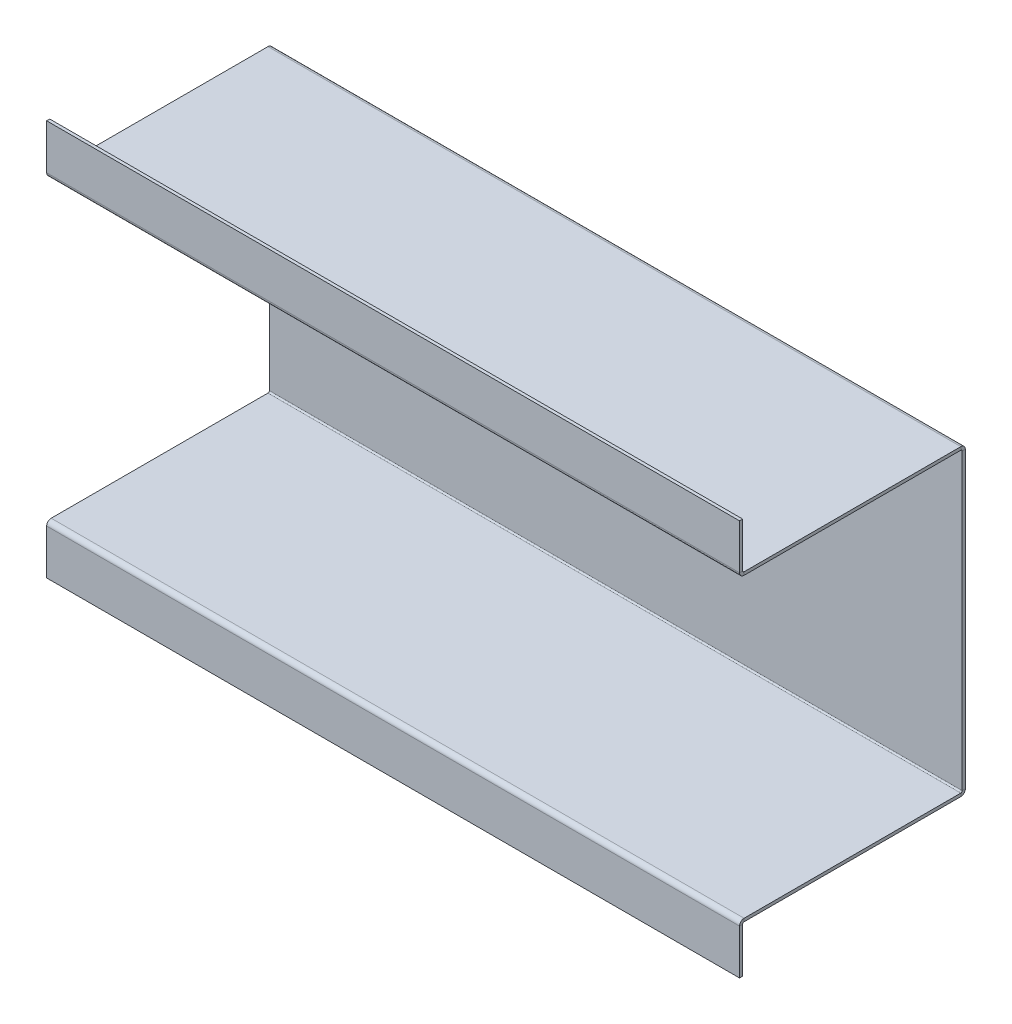
ISO-10303-21;
HEADER;
FILE_DESCRIPTION(('STEP AP214'),'2;1');
FILE_NAME('part.step','',(''),(''),'','','');
FILE_SCHEMA(('AUTOMOTIVE_DESIGN { 1 0 10303 214 1 1 1 1 }'));
ENDSEC;
DATA;
#1=APPLICATION_CONTEXT('core data for automotive mechanical design processes');
#2=APPLICATION_PROTOCOL_DEFINITION('international standard','automotive_design',2000,#1);
#3=PRODUCT_CONTEXT('',#1,'mechanical');
#4=PRODUCT('Part','Part','',(#3));
#5=PRODUCT_RELATED_PRODUCT_CATEGORY('part','',(#4));
#6=PRODUCT_DEFINITION_FORMATION('','',#4);
#7=PRODUCT_DEFINITION_CONTEXT('part definition',#1,'design');
#8=PRODUCT_DEFINITION('design','',#6,#7);
#9=PRODUCT_DEFINITION_SHAPE('','',#8);
#10=(LENGTH_UNIT() NAMED_UNIT(*) SI_UNIT(.MILLI.,.METRE.));
#11=(NAMED_UNIT(*) PLANE_ANGLE_UNIT() SI_UNIT($,.RADIAN.));
#12=(NAMED_UNIT(*) SI_UNIT($,.STERADIAN.) SOLID_ANGLE_UNIT());
#13=UNCERTAINTY_MEASURE_WITH_UNIT(LENGTH_MEASURE(1.E-05),#10,'distance_accuracy_value','');
#14=(GEOMETRIC_REPRESENTATION_CONTEXT(3) GLOBAL_UNCERTAINTY_ASSIGNED_CONTEXT((#13)) GLOBAL_UNIT_ASSIGNED_CONTEXT((#10,
#11,#12)) REPRESENTATION_CONTEXT('',''));
#15=CARTESIAN_POINT('',(0.,0.,0.));
#16=DIRECTION('',(0.,0.,1.));
#17=DIRECTION('',(1.,0.,0.));
#18=AXIS2_PLACEMENT_3D('',#15,#16,#17);
#19=CARTESIAN_POINT('',(355.6,-1.58750000000039,112.7125));
#20=DIRECTION('',(-1.,0.,0.));
#21=DIRECTION('',(0.,0.,1.));
#22=AXIS2_PLACEMENT_3D('',#19,#20,#21);
#23=PLANE('',#22);
#24=DIRECTION('',(0.,1.,0.));
#25=VECTOR('',#24,1.);
#26=CARTESIAN_POINT('',(355.6,-1.58750000000039,111.9759));
#27=LINE('',#26,#25);
#28=CARTESIAN_POINT('',(355.6,-1.58750000000039,111.9759));
#29=VERTEX_POINT('',#28);
#30=CARTESIAN_POINT('',(355.6,-3.90961765250165E-13,111.9759));
#31=VERTEX_POINT('',#30);
#32=EDGE_CURVE('E233',#29,#31,#27,.T.);
#33=ORIENTED_EDGE('',*,*,#32,.F.);
#34=DIRECTION('',(0.,0.,1.));
#35=VECTOR('',#34,1.);
#36=CARTESIAN_POINT('',(355.6,-1.58750000000039,112.7125));
#37=LINE('',#36,#35);
#38=CARTESIAN_POINT('',(355.6,-1.5875,0.736599999999992));
#39=VERTEX_POINT('',#38);
#40=EDGE_CURVE('E298',#39,#29,#37,.T.);
#41=ORIENTED_EDGE('',*,*,#40,.F.);
#42=DIRECTION('',(0.,-1.,0.));
#43=VECTOR('',#42,1.);
#44=CARTESIAN_POINT('',(355.6,0.,0.736599999999997));
#45=LINE('',#44,#43);
#46=CARTESIAN_POINT('',(355.6,0.,0.736599999999997));
#47=VERTEX_POINT('',#46);
#48=EDGE_CURVE('E289',#47,#39,#45,.T.);
#49=ORIENTED_EDGE('',*,*,#48,.F.);
#50=DIRECTION('',(0.,0.,1.));
#51=VECTOR('',#50,1.);
#52=CARTESIAN_POINT('',(355.6,-3.93533590404357E-13,112.7125));
#53=LINE('',#52,#51);
#54=EDGE_CURVE('E297',#47,#31,#53,.T.);
#55=ORIENTED_EDGE('',*,*,#54,.T.);
#56=EDGE_LOOP('',(#33,#41,#49,#55));
#57=FACE_BOUND('',#56,.T.);
#58=ADVANCED_FACE('F39',(#57),#23,.F.);
#59=CARTESIAN_POINT('',(0.,-1.5875,0.));
#60=DIRECTION('',(1.,0.,0.));
#61=DIRECTION('',(0.,0.,-1.));
#62=AXIS2_PLACEMENT_3D('',#59,#60,#61);
#63=PLANE('',#62);
#64=DIRECTION('',(0.,1.,0.));
#65=VECTOR('',#64,1.);
#66=CARTESIAN_POINT('',(0.,-1.58750000000039,111.9759));
#67=LINE('',#66,#65);
#68=CARTESIAN_POINT('',(0.,-1.58750000000039,111.9759));
#69=VERTEX_POINT('',#68);
#70=CARTESIAN_POINT('',(0.,-3.94215909915729E-13,111.9759));
#71=VERTEX_POINT('',#70);
#72=EDGE_CURVE('E226',#69,#71,#67,.T.);
#73=ORIENTED_EDGE('',*,*,#72,.T.);
#74=DIRECTION('',(0.,0.,-1.));
#75=VECTOR('',#74,1.);
#76=CARTESIAN_POINT('',(0.,0.,0.));
#77=LINE('',#76,#75);
#78=CARTESIAN_POINT('',(0.,0.,0.736599999999997));
#79=VERTEX_POINT('',#78);
#80=EDGE_CURVE('E302',#71,#79,#77,.T.);
#81=ORIENTED_EDGE('',*,*,#80,.T.);
#82=DIRECTION('',(0.,-1.,0.));
#83=VECTOR('',#82,1.);
#84=CARTESIAN_POINT('',(0.,0.,0.736599999999997));
#85=LINE('',#84,#83);
#86=CARTESIAN_POINT('',(0.,-1.5875,0.736599999999992));
#87=VERTEX_POINT('',#86);
#88=EDGE_CURVE('E284',#79,#87,#85,.T.);
#89=ORIENTED_EDGE('',*,*,#88,.T.);
#90=DIRECTION('',(0.,0.,-1.));
#91=VECTOR('',#90,1.);
#92=CARTESIAN_POINT('',(0.,-1.5875,0.));
#93=LINE('',#92,#91);
#94=EDGE_CURVE('E301',#69,#87,#93,.T.);
#95=ORIENTED_EDGE('',*,*,#94,.F.);
#96=EDGE_LOOP('',(#73,#81,#89,#95));
#97=FACE_BOUND('',#96,.T.);
#98=ADVANCED_FACE('F460',(#97),#63,.F.);
#99=CARTESIAN_POINT('',(0.,-1.5875,0.));
#100=DIRECTION('',(0.,1.,0.));
#101=DIRECTION('',(0.,0.,1.));
#102=AXIS2_PLACEMENT_3D('',#99,#100,#101);
#103=PLANE('',#102);
#104=DIRECTION('',(-1.,0.,0.));
#105=VECTOR('',#104,1.);
#106=CARTESIAN_POINT('',(0.,-1.58750000000039,111.9759));
#107=LINE('',#106,#105);
#108=EDGE_CURVE('E230',#69,#29,#107,.F.);
#109=ORIENTED_EDGE('',*,*,#108,.F.);
#110=ORIENTED_EDGE('',*,*,#94,.T.);
#111=DIRECTION('',(-1.,0.,0.));
#112=VECTOR('',#111,1.);
#113=CARTESIAN_POINT('',(0.,-1.5875,0.736599999999992));
#114=LINE('',#113,#112);
#115=EDGE_CURVE('E292',#39,#87,#114,.T.);
#116=ORIENTED_EDGE('',*,*,#115,.F.);
#117=ORIENTED_EDGE('',*,*,#40,.T.);
#118=EDGE_LOOP('',(#109,#110,#116,#117));
#119=FACE_BOUND('',#118,.T.);
#120=ADVANCED_FACE('F466',(#119),#103,.F.);
#121=CARTESIAN_POINT('',(0.,0.,0.));
#122=DIRECTION('',(0.,1.,0.));
#123=DIRECTION('',(0.,0.,1.));
#124=AXIS2_PLACEMENT_3D('',#121,#122,#123);
#125=PLANE('',#124);
#126=ORIENTED_EDGE('',*,*,#80,.F.);
#127=DIRECTION('',(-1.,0.,0.));
#128=VECTOR('',#127,1.);
#129=CARTESIAN_POINT('',(0.,-3.94215909915729E-13,111.9759));
#130=LINE('',#129,#128);
#131=EDGE_CURVE('E181',#71,#31,#130,.F.);
#132=ORIENTED_EDGE('',*,*,#131,.T.);
#133=ORIENTED_EDGE('',*,*,#54,.F.);
#134=DIRECTION('',(1.,0.,0.));
#135=VECTOR('',#134,1.);
#136=CARTESIAN_POINT('',(0.,0.,0.736599999999997));
#137=LINE('',#136,#135);
#138=EDGE_CURVE('E287',#79,#47,#137,.T.);
#139=ORIENTED_EDGE('',*,*,#138,.F.);
#140=EDGE_LOOP('',(#126,#132,#133,#139));
#141=FACE_BOUND('',#140,.T.);
#142=ADVANCED_FACE('F491',(#141),#125,.T.);
#143=CARTESIAN_POINT('',(0.,153.9875,112.7125));
#144=DIRECTION('',(1.,0.,0.));
#145=DIRECTION('',(0.,0.,-1.));
#146=AXIS2_PLACEMENT_3D('',#143,#144,#145);
#147=PLANE('',#146);
#148=DIRECTION('',(0.,-1.,0.));
#149=VECTOR('',#148,1.);
#150=CARTESIAN_POINT('',(0.,153.9875,111.9759));
#151=LINE('',#150,#149);
#152=CARTESIAN_POINT('',(0.,153.9875,111.9759));
#153=VERTEX_POINT('',#152);
#154=CARTESIAN_POINT('',(0.,152.4,111.9759));
#155=VERTEX_POINT('',#154);
#156=EDGE_CURVE('E282',#153,#155,#151,.T.);
#157=ORIENTED_EDGE('',*,*,#156,.F.);
#158=DIRECTION('',(0.,0.,1.));
#159=VECTOR('',#158,1.);
#160=CARTESIAN_POINT('',(0.,153.9875,112.7125));
#161=LINE('',#160,#159);
#162=CARTESIAN_POINT('',(0.,153.9875,0.736599999999998));
#163=VERTEX_POINT('',#162);
#164=EDGE_CURVE('E343',#163,#153,#161,.T.);
#165=ORIENTED_EDGE('',*,*,#164,.F.);
#166=DIRECTION('',(0.,1.,0.));
#167=VECTOR('',#166,1.);
#168=CARTESIAN_POINT('',(0.,152.4,0.736600000000004));
#169=LINE('',#168,#167);
#170=CARTESIAN_POINT('',(0.,152.4,0.736600000000004));
#171=VERTEX_POINT('',#170);
#172=EDGE_CURVE('E334',#171,#163,#169,.T.);
#173=ORIENTED_EDGE('',*,*,#172,.F.);
#174=DIRECTION('',(0.,0.,1.));
#175=VECTOR('',#174,1.);
#176=CARTESIAN_POINT('',(0.,152.4,112.7125));
#177=LINE('',#176,#175);
#178=EDGE_CURVE('E342',#171,#155,#177,.T.);
#179=ORIENTED_EDGE('',*,*,#178,.T.);
#180=EDGE_LOOP('',(#157,#165,#173,#179));
#181=FACE_BOUND('',#180,.T.);
#182=ADVANCED_FACE('F402',(#181),#147,.F.);
#183=CARTESIAN_POINT('',(355.6,153.9875,0.));
#184=DIRECTION('',(-1.,0.,0.));
#185=DIRECTION('',(0.,0.,1.));
#186=AXIS2_PLACEMENT_3D('',#183,#184,#185);
#187=PLANE('',#186);
#188=DIRECTION('',(0.,-1.,0.));
#189=VECTOR('',#188,1.);
#190=CARTESIAN_POINT('',(355.6,153.9875,111.9759));
#191=LINE('',#190,#189);
#192=CARTESIAN_POINT('',(355.6,153.9875,111.9759));
#193=VERTEX_POINT('',#192);
#194=CARTESIAN_POINT('',(355.6,152.4,111.9759));
#195=VERTEX_POINT('',#194);
#196=EDGE_CURVE('E272',#193,#195,#191,.T.);
#197=ORIENTED_EDGE('',*,*,#196,.T.);
#198=DIRECTION('',(0.,0.,-1.));
#199=VECTOR('',#198,1.);
#200=CARTESIAN_POINT('',(355.6,152.4,0.));
#201=LINE('',#200,#199);
#202=CARTESIAN_POINT('',(355.6,152.4,0.736600000000004));
#203=VERTEX_POINT('',#202);
#204=EDGE_CURVE('E347',#195,#203,#201,.T.);
#205=ORIENTED_EDGE('',*,*,#204,.T.);
#206=DIRECTION('',(0.,1.,0.));
#207=VECTOR('',#206,1.);
#208=CARTESIAN_POINT('',(355.6,152.4,0.736600000000004));
#209=LINE('',#208,#207);
#210=CARTESIAN_POINT('',(355.6,153.9875,0.736599999999998));
#211=VERTEX_POINT('',#210);
#212=EDGE_CURVE('E329',#203,#211,#209,.T.);
#213=ORIENTED_EDGE('',*,*,#212,.T.);
#214=DIRECTION('',(0.,0.,-1.));
#215=VECTOR('',#214,1.);
#216=CARTESIAN_POINT('',(355.6,153.9875,0.));
#217=LINE('',#216,#215);
#218=EDGE_CURVE('E346',#193,#211,#217,.T.);
#219=ORIENTED_EDGE('',*,*,#218,.F.);
#220=EDGE_LOOP('',(#197,#205,#213,#219));
#221=FACE_BOUND('',#220,.T.);
#222=ADVANCED_FACE('F416',(#221),#187,.F.);
#223=CARTESIAN_POINT('',(0.,153.9875,-5.30944045321262E-13));
#224=DIRECTION('',(0.,-1.,0.));
#225=DIRECTION('',(0.,0.,-1.));
#226=AXIS2_PLACEMENT_3D('',#223,#224,#225);
#227=PLANE('',#226);
#228=DIRECTION('',(1.,0.,0.));
#229=VECTOR('',#228,1.);
#230=CARTESIAN_POINT('',(355.6,153.9875,111.9759));
#231=LINE('',#230,#229);
#232=EDGE_CURVE('E278',#193,#153,#231,.F.);
#233=ORIENTED_EDGE('',*,*,#232,.F.);
#234=ORIENTED_EDGE('',*,*,#218,.T.);
#235=DIRECTION('',(1.,0.,0.));
#236=VECTOR('',#235,1.);
#237=CARTESIAN_POINT('',(0.,153.9875,0.736599999999998));
#238=LINE('',#237,#236);
#239=EDGE_CURVE('E337',#163,#211,#238,.T.);
#240=ORIENTED_EDGE('',*,*,#239,.F.);
#241=ORIENTED_EDGE('',*,*,#164,.T.);
#242=EDGE_LOOP('',(#233,#234,#240,#241));
#243=FACE_BOUND('',#242,.T.);
#244=ADVANCED_FACE('F407',(#243),#227,.F.);
#245=CARTESIAN_POINT('',(0.,152.4,-5.25401318695849E-13));
#246=DIRECTION('',(0.,-1.,0.));
#247=DIRECTION('',(0.,0.,-1.));
#248=AXIS2_PLACEMENT_3D('',#245,#246,#247);
#249=PLANE('',#248);
#250=ORIENTED_EDGE('',*,*,#204,.F.);
#251=DIRECTION('',(1.,0.,0.));
#252=VECTOR('',#251,1.);
#253=CARTESIAN_POINT('',(355.6,152.4,111.9759));
#254=LINE('',#253,#252);
#255=EDGE_CURVE('E267',#195,#155,#254,.F.);
#256=ORIENTED_EDGE('',*,*,#255,.T.);
#257=ORIENTED_EDGE('',*,*,#178,.F.);
#258=DIRECTION('',(-1.,0.,0.));
#259=VECTOR('',#258,1.);
#260=CARTESIAN_POINT('',(355.6,152.4,0.736600000000004));
#261=LINE('',#260,#259);
#262=EDGE_CURVE('E332',#203,#171,#261,.T.);
#263=ORIENTED_EDGE('',*,*,#262,.F.);
#264=EDGE_LOOP('',(#250,#256,#257,#263));
#265=FACE_BOUND('',#264,.T.);
#266=ADVANCED_FACE('F399',(#265),#249,.T.);
#267=CARTESIAN_POINT('',(355.6,0.,-1.5875));
#268=DIRECTION('',(0.,0.,1.));
#269=DIRECTION('',(1.,0.,0.));
#270=AXIS2_PLACEMENT_3D('',#267,#268,#269);
#271=PLANE('',#270);
#272=DIRECTION('',(1.,0.,0.));
#273=VECTOR('',#272,1.);
#274=CARTESIAN_POINT('',(355.6,0.736599999999969,-1.58749999999999));
#275=LINE('',#274,#273);
#276=CARTESIAN_POINT('',(355.6,0.736599999999969,-1.58749999999999));
#277=VERTEX_POINT('',#276);
#278=CARTESIAN_POINT('',(0.,0.736599999999982,-1.5875));
#279=VERTEX_POINT('',#278);
#280=EDGE_CURVE('E308',#277,#279,#275,.F.);
#281=ORIENTED_EDGE('',*,*,#280,.T.);
#282=DIRECTION('',(0.,1.,0.));
#283=VECTOR('',#282,1.);
#284=CARTESIAN_POINT('',(0.,0.,-1.5875));
#285=LINE('',#284,#283);
#286=CARTESIAN_POINT('',(0.,151.6634,-1.5875));
#287=VERTEX_POINT('',#286);
#288=EDGE_CURVE('E374',#279,#287,#285,.T.);
#289=ORIENTED_EDGE('',*,*,#288,.T.);
#290=DIRECTION('',(-1.,0.,0.));
#291=VECTOR('',#290,1.);
#292=CARTESIAN_POINT('',(0.,151.6634,-1.5875));
#293=LINE('',#292,#291);
#294=CARTESIAN_POINT('',(355.6,151.6634,-1.5875));
#295=VERTEX_POINT('',#294);
#296=EDGE_CURVE('E353',#287,#295,#293,.F.);
#297=ORIENTED_EDGE('',*,*,#296,.T.);
#298=DIRECTION('',(0.,1.,0.));
#299=VECTOR('',#298,1.);
#300=CARTESIAN_POINT('',(355.6,0.,-1.5875));
#301=LINE('',#300,#299);
#302=EDGE_CURVE('E48',#277,#295,#301,.T.);
#303=ORIENTED_EDGE('',*,*,#302,.F.);
#304=EDGE_LOOP('',(#281,#289,#297,#303));
#305=FACE_BOUND('',#304,.T.);
#306=ADVANCED_FACE('F41',(#305),#271,.F.);
#307=CARTESIAN_POINT('',(355.6,0.,0.));
#308=DIRECTION('',(0.,0.,1.));
#309=DIRECTION('',(1.,0.,0.));
#310=AXIS2_PLACEMENT_3D('',#307,#308,#309);
#311=PLANE('',#310);
#312=DIRECTION('',(0.,1.,0.));
#313=VECTOR('',#312,1.);
#314=CARTESIAN_POINT('',(0.,0.,0.));
#315=LINE('',#314,#313);
#316=CARTESIAN_POINT('',(0.,0.736599999999971,0.));
#317=VERTEX_POINT('',#316);
#318=CARTESIAN_POINT('',(0.,151.6634,0.));
#319=VERTEX_POINT('',#318);
#320=EDGE_CURVE('E43',#317,#319,#315,.T.);
#321=ORIENTED_EDGE('',*,*,#320,.F.);
#322=DIRECTION('',(1.,0.,0.));
#323=VECTOR('',#322,1.);
#324=CARTESIAN_POINT('',(355.6,0.736599999999997,0.));
#325=LINE('',#324,#323);
#326=CARTESIAN_POINT('',(355.6,0.736600000000003,0.));
#327=VERTEX_POINT('',#326);
#328=EDGE_CURVE('E321',#327,#317,#325,.F.);
#329=ORIENTED_EDGE('',*,*,#328,.F.);
#330=DIRECTION('',(0.,1.,0.));
#331=VECTOR('',#330,1.);
#332=CARTESIAN_POINT('',(355.6,0.,0.));
#333=LINE('',#332,#331);
#334=CARTESIAN_POINT('',(355.6,151.6634,0.));
#335=VERTEX_POINT('',#334);
#336=EDGE_CURVE('E11',#327,#335,#333,.T.);
#337=ORIENTED_EDGE('',*,*,#336,.T.);
#338=DIRECTION('',(-1.,0.,0.));
#339=VECTOR('',#338,1.);
#340=CARTESIAN_POINT('',(0.,151.6634,0.));
#341=LINE('',#340,#339);
#342=EDGE_CURVE('E366',#319,#335,#341,.F.);
#343=ORIENTED_EDGE('',*,*,#342,.F.);
#344=EDGE_LOOP('',(#321,#329,#337,#343));
#345=FACE_BOUND('',#344,.T.);
#346=ADVANCED_FACE('F385',(#345),#311,.T.);
#347=CARTESIAN_POINT('',(355.6,0.,0.));
#348=DIRECTION('',(-1.,0.,0.));
#349=DIRECTION('',(0.,0.,1.));
#350=AXIS2_PLACEMENT_3D('',#347,#348,#349);
#351=PLANE('',#350);
#352=DIRECTION('',(0.,0.,-1.));
#353=VECTOR('',#352,1.);
#354=CARTESIAN_POINT('',(355.6,0.736599999999997,0.));
#355=LINE('',#354,#353);
#356=EDGE_CURVE('E315',#327,#277,#355,.T.);
#357=ORIENTED_EDGE('',*,*,#356,.T.);
#358=ORIENTED_EDGE('',*,*,#302,.T.);
#359=DIRECTION('',(0.,0.,-1.));
#360=VECTOR('',#359,1.);
#361=CARTESIAN_POINT('',(355.6,151.6634,0.));
#362=LINE('',#361,#360);
#363=EDGE_CURVE('E371',#335,#295,#362,.T.);
#364=ORIENTED_EDGE('',*,*,#363,.F.);
#365=ORIENTED_EDGE('',*,*,#336,.F.);
#366=EDGE_LOOP('',(#357,#358,#364,#365));
#367=FACE_BOUND('',#366,.T.);
#368=ADVANCED_FACE('F500',(#367),#351,.F.);
#369=CARTESIAN_POINT('',(0.,0.,0.));
#370=DIRECTION('',(-1.,0.,0.));
#371=DIRECTION('',(0.,0.,1.));
#372=AXIS2_PLACEMENT_3D('',#369,#370,#371);
#373=PLANE('',#372);
#374=DIRECTION('',(0.,0.,-1.));
#375=VECTOR('',#374,1.);
#376=CARTESIAN_POINT('',(0.,0.736599999999971,0.));
#377=LINE('',#376,#375);
#378=EDGE_CURVE('E326',#317,#279,#377,.T.);
#379=ORIENTED_EDGE('',*,*,#378,.F.);
#380=ORIENTED_EDGE('',*,*,#320,.T.);
#381=DIRECTION('',(0.,0.,-1.));
#382=VECTOR('',#381,1.);
#383=CARTESIAN_POINT('',(0.,151.6634,0.));
#384=LINE('',#383,#382);
#385=EDGE_CURVE('E360',#319,#287,#384,.T.);
#386=ORIENTED_EDGE('',*,*,#385,.T.);
#387=ORIENTED_EDGE('',*,*,#288,.F.);
#388=EDGE_LOOP('',(#379,#380,#386,#387));
#389=FACE_BOUND('',#388,.T.);
#390=ADVANCED_FACE('F382',(#389),#373,.T.);
#391=CARTESIAN_POINT('',(355.6,151.6634,0.736600000000006));
#392=DIRECTION('',(1.,0.,0.));
#393=DIRECTION('',(0.,0.,-1.));
#394=AXIS2_PLACEMENT_3D('',#391,#392,#393);
#395=PLANE('',#394);
#396=ORIENTED_EDGE('',*,*,#212,.F.);
#397=CARTESIAN_POINT('',(355.6,151.6634,0.736600000000006));
#398=DIRECTION('',(-1.,0.,0.));
#399=DIRECTION('',(0.,0.,1.));
#400=AXIS2_PLACEMENT_3D('',#397,#398,#399);
#401=CIRCLE('',#400,0.736600000000004);
#402=EDGE_CURVE('E363',#335,#203,#401,.F.);
#403=ORIENTED_EDGE('',*,*,#402,.F.);
#404=ORIENTED_EDGE('',*,*,#363,.T.);
#405=CARTESIAN_POINT('',(355.6,151.6634,0.736600000000006));
#406=DIRECTION('',(-1.,0.,0.));
#407=DIRECTION('',(0.,0.,1.));
#408=AXIS2_PLACEMENT_3D('',#405,#406,#407);
#409=CIRCLE('',#408,2.3241);
#410=EDGE_CURVE('E356',#295,#211,#409,.F.);
#411=ORIENTED_EDGE('',*,*,#410,.T.);
#412=EDGE_LOOP('',(#396,#403,#404,#411));
#413=FACE_BOUND('',#412,.T.);
#414=ADVANCED_FACE('F414',(#413),#395,.T.);
#415=CARTESIAN_POINT('',(0.,151.6634,0.736600000000006));
#416=DIRECTION('',(1.,0.,0.));
#417=DIRECTION('',(0.,0.,-1.));
#418=AXIS2_PLACEMENT_3D('',#415,#416,#417);
#419=PLANE('',#418);
#420=CARTESIAN_POINT('',(0.,151.6634,0.736600000000006));
#421=DIRECTION('',(-1.,0.,0.));
#422=DIRECTION('',(0.,0.,1.));
#423=AXIS2_PLACEMENT_3D('',#420,#421,#422);
#424=CIRCLE('',#423,0.736600000000004);
#425=EDGE_CURVE('E349',#171,#319,#424,.T.);
#426=ORIENTED_EDGE('',*,*,#425,.F.);
#427=ORIENTED_EDGE('',*,*,#172,.T.);
#428=CARTESIAN_POINT('',(0.,151.6634,0.736600000000006));
#429=DIRECTION('',(-1.,0.,0.));
#430=DIRECTION('',(0.,0.,1.));
#431=AXIS2_PLACEMENT_3D('',#428,#429,#430);
#432=CIRCLE('',#431,2.3241);
#433=EDGE_CURVE('E357',#163,#287,#432,.T.);
#434=ORIENTED_EDGE('',*,*,#433,.T.);
#435=ORIENTED_EDGE('',*,*,#385,.F.);
#436=EDGE_LOOP('',(#426,#427,#434,#435));
#437=FACE_BOUND('',#436,.T.);
#438=ADVANCED_FACE('F392',(#437),#419,.F.);
#439=CARTESIAN_POINT('',(0.,151.6634,0.736600000000006));
#440=DIRECTION('',(-1.,0.,0.));
#441=DIRECTION('',(0.,1.,0.));
#442=AXIS2_PLACEMENT_3D('',#439,#440,#441);
#443=CYLINDRICAL_SURFACE('',#442,2.3241);
#444=ORIENTED_EDGE('',*,*,#296,.F.);
#445=ORIENTED_EDGE('',*,*,#433,.F.);
#446=ORIENTED_EDGE('',*,*,#239,.T.);
#447=ORIENTED_EDGE('',*,*,#410,.F.);
#448=EDGE_LOOP('',(#444,#445,#446,#447));
#449=FACE_BOUND('',#448,.T.);
#450=ADVANCED_FACE('F411',(#449),#443,.T.);
#451=CARTESIAN_POINT('',(0.,151.6634,0.736600000000006));
#452=DIRECTION('',(-1.,0.,0.));
#453=DIRECTION('',(0.,1.,0.));
#454=AXIS2_PLACEMENT_3D('',#451,#452,#453);
#455=CYLINDRICAL_SURFACE('',#454,0.736600000000004);
#456=ORIENTED_EDGE('',*,*,#342,.T.);
#457=ORIENTED_EDGE('',*,*,#402,.T.);
#458=ORIENTED_EDGE('',*,*,#262,.T.);
#459=ORIENTED_EDGE('',*,*,#425,.T.);
#460=EDGE_LOOP('',(#456,#457,#458,#459));
#461=FACE_BOUND('',#460,.T.);
#462=ADVANCED_FACE('F394',(#461),#455,.F.);
#463=CARTESIAN_POINT('',(0.,0.736599999999984,0.7366));
#464=DIRECTION('',(-1.,0.,0.));
#465=DIRECTION('',(0.,-1.,0.));
#466=AXIS2_PLACEMENT_3D('',#463,#464,#465);
#467=PLANE('',#466);
#468=ORIENTED_EDGE('',*,*,#88,.F.);
#469=CARTESIAN_POINT('',(0.,0.736599999999984,0.7366));
#470=DIRECTION('',(1.,0.,0.));
#471=DIRECTION('',(0.,1.,0.));
#472=AXIS2_PLACEMENT_3D('',#469,#470,#471);
#473=CIRCLE('',#472,0.736599999999987);
#474=EDGE_CURVE('E318',#317,#79,#473,.F.);
#475=ORIENTED_EDGE('',*,*,#474,.F.);
#476=ORIENTED_EDGE('',*,*,#378,.T.);
#477=CARTESIAN_POINT('',(0.,0.736599999999984,0.7366));
#478=DIRECTION('',(1.,0.,0.));
#479=DIRECTION('',(0.,1.,0.));
#480=AXIS2_PLACEMENT_3D('',#477,#478,#479);
#481=CIRCLE('',#480,2.32409999999999);
#482=EDGE_CURVE('E311',#279,#87,#481,.F.);
#483=ORIENTED_EDGE('',*,*,#482,.T.);
#484=EDGE_LOOP('',(#468,#475,#476,#483));
#485=FACE_BOUND('',#484,.T.);
#486=ADVANCED_FACE('F476',(#485),#467,.T.);
#487=CARTESIAN_POINT('',(355.6,0.73660000000001,0.7366));
#488=DIRECTION('',(-1.,0.,0.));
#489=DIRECTION('',(0.,-1.,0.));
#490=AXIS2_PLACEMENT_3D('',#487,#488,#489);
#491=PLANE('',#490);
#492=CARTESIAN_POINT('',(355.6,0.73660000000001,0.7366));
#493=DIRECTION('',(1.,0.,0.));
#494=DIRECTION('',(0.,1.,0.));
#495=AXIS2_PLACEMENT_3D('',#492,#493,#494);
#496=CIRCLE('',#495,0.736599999999987);
#497=EDGE_CURVE('E304',#47,#327,#496,.T.);
#498=ORIENTED_EDGE('',*,*,#497,.F.);
#499=ORIENTED_EDGE('',*,*,#48,.T.);
#500=CARTESIAN_POINT('',(355.6,0.73660000000001,0.7366));
#501=DIRECTION('',(1.,0.,0.));
#502=DIRECTION('',(0.,1.,0.));
#503=AXIS2_PLACEMENT_3D('',#500,#501,#502);
#504=CIRCLE('',#503,2.32409999999999);
#505=EDGE_CURVE('E312',#39,#277,#504,.T.);
#506=ORIENTED_EDGE('',*,*,#505,.T.);
#507=ORIENTED_EDGE('',*,*,#356,.F.);
#508=EDGE_LOOP('',(#498,#499,#506,#507));
#509=FACE_BOUND('',#508,.T.);
#510=ADVANCED_FACE('F473',(#509),#491,.F.);
#511=CARTESIAN_POINT('',(355.6,0.73660000000001,0.7366));
#512=DIRECTION('',(1.,0.,0.));
#513=DIRECTION('',(0.,-1.,0.));
#514=AXIS2_PLACEMENT_3D('',#511,#512,#513);
#515=CYLINDRICAL_SURFACE('',#514,2.32409999999999);
#516=ORIENTED_EDGE('',*,*,#280,.F.);
#517=ORIENTED_EDGE('',*,*,#505,.F.);
#518=ORIENTED_EDGE('',*,*,#115,.T.);
#519=ORIENTED_EDGE('',*,*,#482,.F.);
#520=EDGE_LOOP('',(#516,#517,#518,#519));
#521=FACE_BOUND('',#520,.T.);
#522=ADVANCED_FACE('F455',(#521),#515,.T.);
#523=CARTESIAN_POINT('',(355.6,0.73660000000001,0.7366));
#524=DIRECTION('',(1.,0.,0.));
#525=DIRECTION('',(0.,-1.,0.));
#526=AXIS2_PLACEMENT_3D('',#523,#524,#525);
#527=CYLINDRICAL_SURFACE('',#526,0.736599999999987);
#528=ORIENTED_EDGE('',*,*,#328,.T.);
#529=ORIENTED_EDGE('',*,*,#474,.T.);
#530=ORIENTED_EDGE('',*,*,#138,.T.);
#531=ORIENTED_EDGE('',*,*,#497,.T.);
#532=EDGE_LOOP('',(#528,#529,#530,#531));
#533=FACE_BOUND('',#532,.T.);
#534=ADVANCED_FACE('F448',(#533),#527,.F.);
#535=CARTESIAN_POINT('',(0.,154.7241,111.9759));
#536=DIRECTION('',(-1.,0.,0.));
#537=DIRECTION('',(0.,0.,1.));
#538=AXIS2_PLACEMENT_3D('',#535,#536,#537);
#539=PLANE('',#538);
#540=DIRECTION('',(0.,0.,1.));
#541=VECTOR('',#540,1.);
#542=CARTESIAN_POINT('',(0.,154.7241,112.7125));
#543=LINE('',#542,#541);
#544=CARTESIAN_POINT('',(0.,154.7241,112.7125));
#545=VERTEX_POINT('',#544);
#546=CARTESIAN_POINT('',(0.,154.7241,114.3));
#547=VERTEX_POINT('',#546);
#548=EDGE_CURVE('E235',#545,#547,#543,.T.);
#549=ORIENTED_EDGE('',*,*,#548,.F.);
#550=CARTESIAN_POINT('',(0.,154.7241,111.9759));
#551=DIRECTION('',(1.,0.,0.));
#552=DIRECTION('',(0.,0.,-1.));
#553=AXIS2_PLACEMENT_3D('',#550,#551,#552);
#554=CIRCLE('',#553,0.736600000000004);
#555=EDGE_CURVE('E275',#153,#545,#554,.F.);
#556=ORIENTED_EDGE('',*,*,#555,.F.);
#557=ORIENTED_EDGE('',*,*,#156,.T.);
#558=CARTESIAN_POINT('',(0.,154.7241,111.9759));
#559=DIRECTION('',(1.,0.,0.));
#560=DIRECTION('',(0.,0.,-1.));
#561=AXIS2_PLACEMENT_3D('',#558,#559,#560);
#562=CIRCLE('',#561,2.3241);
#563=EDGE_CURVE('E64',#155,#547,#562,.F.);
#564=ORIENTED_EDGE('',*,*,#563,.T.);
#565=EDGE_LOOP('',(#549,#556,#557,#564));
#566=FACE_BOUND('',#565,.T.);
#567=ADVANCED_FACE('F446',(#566),#539,.T.);
#568=CARTESIAN_POINT('',(355.6,154.7241,111.9759));
#569=DIRECTION('',(-1.,0.,0.));
#570=DIRECTION('',(0.,0.,1.));
#571=AXIS2_PLACEMENT_3D('',#568,#569,#570);
#572=PLANE('',#571);
#573=CARTESIAN_POINT('',(355.6,154.7241,111.9759));
#574=DIRECTION('',(1.,0.,0.));
#575=DIRECTION('',(0.,0.,-1.));
#576=AXIS2_PLACEMENT_3D('',#573,#574,#575);
#577=CIRCLE('',#576,0.736600000000004);
#578=CARTESIAN_POINT('',(355.6,154.7241,112.7125));
#579=VERTEX_POINT('',#578);
#580=EDGE_CURVE('E266',#579,#193,#577,.T.);
#581=ORIENTED_EDGE('',*,*,#580,.F.);
#582=DIRECTION('',(0.,0.,1.));
#583=VECTOR('',#582,1.);
#584=CARTESIAN_POINT('',(355.6,154.7241,112.7125));
#585=LINE('',#584,#583);
#586=CARTESIAN_POINT('',(355.6,154.7241,114.3));
#587=VERTEX_POINT('',#586);
#588=EDGE_CURVE('E239',#579,#587,#585,.T.);
#589=ORIENTED_EDGE('',*,*,#588,.T.);
#590=CARTESIAN_POINT('',(355.6,154.7241,111.9759));
#591=DIRECTION('',(1.,0.,0.));
#592=DIRECTION('',(0.,0.,-1.));
#593=AXIS2_PLACEMENT_3D('',#590,#591,#592);
#594=CIRCLE('',#593,2.3241);
#595=EDGE_CURVE('E270',#587,#195,#594,.T.);
#596=ORIENTED_EDGE('',*,*,#595,.T.);
#597=ORIENTED_EDGE('',*,*,#196,.F.);
#598=EDGE_LOOP('',(#581,#589,#596,#597));
#599=FACE_BOUND('',#598,.T.);
#600=ADVANCED_FACE('F419',(#599),#572,.F.);
#601=CARTESIAN_POINT('',(355.6,154.7241,111.9759));
#602=DIRECTION('',(1.,0.,0.));
#603=DIRECTION('',(0.,0.,1.));
#604=AXIS2_PLACEMENT_3D('',#601,#602,#603);
#605=CYLINDRICAL_SURFACE('',#604,2.3241);
#606=ORIENTED_EDGE('',*,*,#255,.F.);
#607=ORIENTED_EDGE('',*,*,#595,.F.);
#608=DIRECTION('',(-1.,0.,0.));
#609=VECTOR('',#608,1.);
#610=CARTESIAN_POINT('',(0.,154.7241,114.3));
#611=LINE('',#610,#609);
#612=EDGE_CURVE('E242',#587,#547,#611,.T.);
#613=ORIENTED_EDGE('',*,*,#612,.T.);
#614=ORIENTED_EDGE('',*,*,#563,.F.);
#615=EDGE_LOOP('',(#606,#607,#613,#614));
#616=FACE_BOUND('',#615,.T.);
#617=ADVANCED_FACE('F444',(#616),#605,.T.);
#618=CARTESIAN_POINT('',(355.6,154.7241,111.9759));
#619=DIRECTION('',(1.,0.,0.));
#620=DIRECTION('',(0.,0.,1.));
#621=AXIS2_PLACEMENT_3D('',#618,#619,#620);
#622=CYLINDRICAL_SURFACE('',#621,0.736600000000004);
#623=ORIENTED_EDGE('',*,*,#232,.T.);
#624=ORIENTED_EDGE('',*,*,#555,.T.);
#625=DIRECTION('',(1.,0.,0.));
#626=VECTOR('',#625,1.);
#627=CARTESIAN_POINT('',(0.,154.7241,112.7125));
#628=LINE('',#627,#626);
#629=EDGE_CURVE('E237',#545,#579,#628,.T.);
#630=ORIENTED_EDGE('',*,*,#629,.T.);
#631=ORIENTED_EDGE('',*,*,#580,.T.);
#632=EDGE_LOOP('',(#623,#624,#630,#631));
#633=FACE_BOUND('',#632,.T.);
#634=ADVANCED_FACE('F422',(#633),#622,.F.);
#635=CARTESIAN_POINT('',(355.6,177.8,114.3));
#636=DIRECTION('',(-1.,0.,0.));
#637=DIRECTION('',(0.,0.,1.));
#638=AXIS2_PLACEMENT_3D('',#635,#636,#637);
#639=PLANE('',#638);
#640=ORIENTED_EDGE('',*,*,#588,.F.);
#641=DIRECTION('',(0.,1.,0.));
#642=VECTOR('',#641,1.);
#643=CARTESIAN_POINT('',(355.6,177.8,112.7125));
#644=LINE('',#643,#642);
#645=CARTESIAN_POINT('',(355.6,177.8,112.7125));
#646=VERTEX_POINT('',#645);
#647=EDGE_CURVE('E246',#579,#646,#644,.T.);
#648=ORIENTED_EDGE('',*,*,#647,.T.);
#649=DIRECTION('',(0.,0.,-1.));
#650=VECTOR('',#649,1.);
#651=CARTESIAN_POINT('',(355.6,177.8,114.3));
#652=LINE('',#651,#650);
#653=CARTESIAN_POINT('',(355.6,177.8,114.3));
#654=VERTEX_POINT('',#653);
#655=EDGE_CURVE('E263',#654,#646,#652,.T.);
#656=ORIENTED_EDGE('',*,*,#655,.F.);
#657=DIRECTION('',(0.,1.,0.));
#658=VECTOR('',#657,1.);
#659=CARTESIAN_POINT('',(355.6,177.8,114.3));
#660=LINE('',#659,#658);
#661=EDGE_CURVE('E247',#587,#654,#660,.T.);
#662=ORIENTED_EDGE('',*,*,#661,.F.);
#663=EDGE_LOOP('',(#640,#648,#656,#662));
#664=FACE_BOUND('',#663,.T.);
#665=ADVANCED_FACE('F440',(#664),#639,.F.);
#666=CARTESIAN_POINT('',(0.,153.9875,114.3));
#667=DIRECTION('',(1.,0.,0.));
#668=DIRECTION('',(0.,0.,-1.));
#669=AXIS2_PLACEMENT_3D('',#666,#667,#668);
#670=PLANE('',#669);
#671=ORIENTED_EDGE('',*,*,#548,.T.);
#672=DIRECTION('',(0.,-1.,0.));
#673=VECTOR('',#672,1.);
#674=CARTESIAN_POINT('',(0.,153.9875,114.3));
#675=LINE('',#674,#673);
#676=CARTESIAN_POINT('',(0.,177.8,114.3));
#677=VERTEX_POINT('',#676);
#678=EDGE_CURVE('E252',#677,#547,#675,.T.);
#679=ORIENTED_EDGE('',*,*,#678,.F.);
#680=DIRECTION('',(0.,0.,-1.));
#681=VECTOR('',#680,1.);
#682=CARTESIAN_POINT('',(0.,177.8,114.3));
#683=LINE('',#682,#681);
#684=CARTESIAN_POINT('',(0.,177.8,112.7125));
#685=VERTEX_POINT('',#684);
#686=EDGE_CURVE('E255',#677,#685,#683,.T.);
#687=ORIENTED_EDGE('',*,*,#686,.T.);
#688=DIRECTION('',(0.,-1.,0.));
#689=VECTOR('',#688,1.);
#690=CARTESIAN_POINT('',(0.,153.9875,112.7125));
#691=LINE('',#690,#689);
#692=EDGE_CURVE('E250',#685,#545,#691,.T.);
#693=ORIENTED_EDGE('',*,*,#692,.T.);
#694=EDGE_LOOP('',(#671,#679,#687,#693));
#695=FACE_BOUND('',#694,.T.);
#696=ADVANCED_FACE('F431',(#695),#670,.F.);
#697=CARTESIAN_POINT('',(0.,0.,114.3));
#698=DIRECTION('',(0.,0.,-1.));
#699=DIRECTION('',(-1.,0.,0.));
#700=AXIS2_PLACEMENT_3D('',#697,#698,#699);
#701=PLANE('',#700);
#702=ORIENTED_EDGE('',*,*,#612,.F.);
#703=ORIENTED_EDGE('',*,*,#661,.T.);
#704=DIRECTION('',(-1.,0.,0.));
#705=VECTOR('',#704,1.);
#706=CARTESIAN_POINT('',(0.,177.8,114.3));
#707=LINE('',#706,#705);
#708=EDGE_CURVE('E249',#654,#677,#707,.T.);
#709=ORIENTED_EDGE('',*,*,#708,.T.);
#710=ORIENTED_EDGE('',*,*,#678,.T.);
#711=EDGE_LOOP('',(#702,#703,#709,#710));
#712=FACE_BOUND('',#711,.T.);
#713=ADVANCED_FACE('F443',(#712),#701,.F.);
#714=CARTESIAN_POINT('',(0.,0.,112.7125));
#715=DIRECTION('',(0.,0.,-1.));
#716=DIRECTION('',(-1.,0.,0.));
#717=AXIS2_PLACEMENT_3D('',#714,#715,#716);
#718=PLANE('',#717);
#719=ORIENTED_EDGE('',*,*,#647,.F.);
#720=ORIENTED_EDGE('',*,*,#629,.F.);
#721=ORIENTED_EDGE('',*,*,#692,.F.);
#722=DIRECTION('',(-1.,0.,0.));
#723=VECTOR('',#722,1.);
#724=CARTESIAN_POINT('',(0.,177.8,112.7125));
#725=LINE('',#724,#723);
#726=EDGE_CURVE('E257',#646,#685,#725,.T.);
#727=ORIENTED_EDGE('',*,*,#726,.F.);
#728=EDGE_LOOP('',(#719,#720,#721,#727));
#729=FACE_BOUND('',#728,.T.);
#730=ADVANCED_FACE('F428',(#729),#718,.T.);
#731=CARTESIAN_POINT('',(0.,177.8,114.3));
#732=DIRECTION('',(0.,-1.,0.));
#733=DIRECTION('',(0.,0.,-1.));
#734=AXIS2_PLACEMENT_3D('',#731,#732,#733);
#735=PLANE('',#734);
#736=ORIENTED_EDGE('',*,*,#726,.T.);
#737=ORIENTED_EDGE('',*,*,#686,.F.);
#738=ORIENTED_EDGE('',*,*,#708,.F.);
#739=ORIENTED_EDGE('',*,*,#655,.T.);
#740=EDGE_LOOP('',(#736,#737,#738,#739));
#741=FACE_BOUND('',#740,.T.);
#742=ADVANCED_FACE('F436',(#741),#735,.F.);
#743=CARTESIAN_POINT('',(355.6,-2.3241000000004,111.9759));
#744=DIRECTION('',(1.,0.,0.));
#745=DIRECTION('',(0.,0.,-1.));
#746=AXIS2_PLACEMENT_3D('',#743,#744,#745);
#747=PLANE('',#746);
#748=DIRECTION('',(0.,0.,1.));
#749=VECTOR('',#748,1.);
#750=CARTESIAN_POINT('',(355.6,-2.3241000000004,112.7125));
#751=LINE('',#750,#749);
#752=CARTESIAN_POINT('',(355.6,-2.3241000000004,112.7125));
#753=VERTEX_POINT('',#752);
#754=CARTESIAN_POINT('',(355.6,-2.3241000000004,114.3));
#755=VERTEX_POINT('',#754);
#756=EDGE_CURVE('E536',#753,#755,#751,.T.);
#757=ORIENTED_EDGE('',*,*,#756,.F.);
#758=CARTESIAN_POINT('',(355.6,-2.3241000000004,111.9759));
#759=DIRECTION('',(-1.,0.,0.));
#760=DIRECTION('',(0.,0.,1.));
#761=AXIS2_PLACEMENT_3D('',#758,#759,#760);
#762=CIRCLE('',#761,0.736600000000004);
#763=EDGE_CURVE('E184',#29,#753,#762,.F.);
#764=ORIENTED_EDGE('',*,*,#763,.F.);
#765=ORIENTED_EDGE('',*,*,#32,.T.);
#766=CARTESIAN_POINT('',(355.6,-2.3241000000004,111.9759));
#767=DIRECTION('',(-1.,0.,0.));
#768=DIRECTION('',(0.,0.,1.));
#769=AXIS2_PLACEMENT_3D('',#766,#767,#768);
#770=CIRCLE('',#769,2.3241);
#771=EDGE_CURVE('E56',#31,#755,#770,.F.);
#772=ORIENTED_EDGE('',*,*,#771,.T.);
#773=EDGE_LOOP('',(#757,#764,#765,#772));
#774=FACE_BOUND('',#773,.T.);
#775=ADVANCED_FACE('F524',(#774),#747,.T.);
#776=CARTESIAN_POINT('',(0.,-2.3241000000004,111.9759));
#777=DIRECTION('',(1.,0.,0.));
#778=DIRECTION('',(0.,0.,-1.));
#779=AXIS2_PLACEMENT_3D('',#776,#777,#778);
#780=PLANE('',#779);
#781=CARTESIAN_POINT('',(0.,-2.3241000000004,111.9759));
#782=DIRECTION('',(-1.,0.,0.));
#783=DIRECTION('',(0.,0.,1.));
#784=AXIS2_PLACEMENT_3D('',#781,#782,#783);
#785=CIRCLE('',#784,0.736600000000004);
#786=CARTESIAN_POINT('',(0.,-2.3241000000004,112.7125));
#787=VERTEX_POINT('',#786);
#788=EDGE_CURVE('E191',#787,#69,#785,.T.);
#789=ORIENTED_EDGE('',*,*,#788,.F.);
#790=DIRECTION('',(0.,0.,1.));
#791=VECTOR('',#790,1.);
#792=CARTESIAN_POINT('',(0.,-2.3241000000004,112.7125));
#793=LINE('',#792,#791);
#794=CARTESIAN_POINT('',(0.,-2.3241000000004,114.3));
#795=VERTEX_POINT('',#794);
#796=EDGE_CURVE('E188',#787,#795,#793,.T.);
#797=ORIENTED_EDGE('',*,*,#796,.T.);
#798=CARTESIAN_POINT('',(0.,-2.3241000000004,111.9759));
#799=DIRECTION('',(-1.,0.,0.));
#800=DIRECTION('',(0.,0.,1.));
#801=AXIS2_PLACEMENT_3D('',#798,#799,#800);
#802=CIRCLE('',#801,2.3241);
#803=EDGE_CURVE('E175',#795,#71,#802,.T.);
#804=ORIENTED_EDGE('',*,*,#803,.T.);
#805=ORIENTED_EDGE('',*,*,#72,.F.);
#806=EDGE_LOOP('',(#789,#797,#804,#805));
#807=FACE_BOUND('',#806,.T.);
#808=ADVANCED_FACE('F189',(#807),#780,.F.);
#809=CARTESIAN_POINT('',(0.,-2.3241000000004,111.9759));
#810=DIRECTION('',(-1.,0.,0.));
#811=DIRECTION('',(0.,0.,1.));
#812=AXIS2_PLACEMENT_3D('',#809,#810,#811);
#813=CYLINDRICAL_SURFACE('',#812,2.3241);
#814=ORIENTED_EDGE('',*,*,#131,.F.);
#815=ORIENTED_EDGE('',*,*,#803,.F.);
#816=DIRECTION('',(1.,0.,0.));
#817=VECTOR('',#816,1.);
#818=CARTESIAN_POINT('',(0.,-2.3241000000004,114.3));
#819=LINE('',#818,#817);
#820=EDGE_CURVE('E179',#795,#755,#819,.T.);
#821=ORIENTED_EDGE('',*,*,#820,.T.);
#822=ORIENTED_EDGE('',*,*,#771,.F.);
#823=EDGE_LOOP('',(#814,#815,#821,#822));
#824=FACE_BOUND('',#823,.T.);
#825=ADVANCED_FACE('F177',(#824),#813,.T.);
#826=CARTESIAN_POINT('',(0.,-2.3241000000004,111.9759));
#827=DIRECTION('',(-1.,0.,0.));
#828=DIRECTION('',(0.,0.,1.));
#829=AXIS2_PLACEMENT_3D('',#826,#827,#828);
#830=CYLINDRICAL_SURFACE('',#829,0.736600000000004);
#831=ORIENTED_EDGE('',*,*,#108,.T.);
#832=ORIENTED_EDGE('',*,*,#763,.T.);
#833=DIRECTION('',(-1.,0.,0.));
#834=VECTOR('',#833,1.);
#835=CARTESIAN_POINT('',(355.6,-2.3241000000004,112.7125));
#836=LINE('',#835,#834);
#837=EDGE_CURVE('E195',#753,#787,#836,.T.);
#838=ORIENTED_EDGE('',*,*,#837,.T.);
#839=ORIENTED_EDGE('',*,*,#788,.T.);
#840=EDGE_LOOP('',(#831,#832,#838,#839));
#841=FACE_BOUND('',#840,.T.);
#842=ADVANCED_FACE('F532',(#841),#830,.F.);
#843=CARTESIAN_POINT('',(355.6,-1.58750000000039,114.3));
#844=DIRECTION('',(-1.,0.,0.));
#845=DIRECTION('',(0.,0.,1.));
#846=AXIS2_PLACEMENT_3D('',#843,#844,#845);
#847=PLANE('',#846);
#848=ORIENTED_EDGE('',*,*,#756,.T.);
#849=DIRECTION('',(0.,1.,0.));
#850=VECTOR('',#849,1.);
#851=CARTESIAN_POINT('',(355.6,-1.58750000000039,114.3));
#852=LINE('',#851,#850);
#853=CARTESIAN_POINT('',(355.6,-25.4000000000004,114.3));
#854=VERTEX_POINT('',#853);
#855=EDGE_CURVE('E203',#854,#755,#852,.T.);
#856=ORIENTED_EDGE('',*,*,#855,.F.);
#857=DIRECTION('',(0.,0.,-1.));
#858=VECTOR('',#857,1.);
#859=CARTESIAN_POINT('',(355.6,-25.4000000000004,114.3));
#860=LINE('',#859,#858);
#861=CARTESIAN_POINT('',(355.6,-25.4000000000004,112.7125));
#862=VERTEX_POINT('',#861);
#863=EDGE_CURVE('E212',#854,#862,#860,.T.);
#864=ORIENTED_EDGE('',*,*,#863,.T.);
#865=DIRECTION('',(0.,1.,0.));
#866=VECTOR('',#865,1.);
#867=CARTESIAN_POINT('',(355.6,-1.58750000000039,112.7125));
#868=LINE('',#867,#866);
#869=EDGE_CURVE('E204',#862,#753,#868,.T.);
#870=ORIENTED_EDGE('',*,*,#869,.T.);
#871=EDGE_LOOP('',(#848,#856,#864,#870));
#872=FACE_BOUND('',#871,.T.);
#873=ADVANCED_FACE('F540',(#872),#847,.F.);
#874=CARTESIAN_POINT('',(0.,-25.4000000000004,114.3));
#875=DIRECTION('',(1.,0.,0.));
#876=DIRECTION('',(0.,0.,-1.));
#877=AXIS2_PLACEMENT_3D('',#874,#875,#876);
#878=PLANE('',#877);
#879=ORIENTED_EDGE('',*,*,#796,.F.);
#880=DIRECTION('',(0.,-1.,0.));
#881=VECTOR('',#880,1.);
#882=CARTESIAN_POINT('',(0.,-25.4000000000004,112.7125));
#883=LINE('',#882,#881);
#884=CARTESIAN_POINT('',(0.,-25.4000000000004,112.7125));
#885=VERTEX_POINT('',#884);
#886=EDGE_CURVE('E219',#787,#885,#883,.T.);
#887=ORIENTED_EDGE('',*,*,#886,.T.);
#888=DIRECTION('',(0.,0.,-1.));
#889=VECTOR('',#888,1.);
#890=CARTESIAN_POINT('',(0.,-25.4000000000004,114.3));
#891=LINE('',#890,#889);
#892=CARTESIAN_POINT('',(0.,-25.4000000000004,114.3));
#893=VERTEX_POINT('',#892);
#894=EDGE_CURVE('E208',#893,#885,#891,.T.);
#895=ORIENTED_EDGE('',*,*,#894,.F.);
#896=DIRECTION('',(0.,-1.,0.));
#897=VECTOR('',#896,1.);
#898=CARTESIAN_POINT('',(0.,-25.4000000000004,114.3));
#899=LINE('',#898,#897);
#900=EDGE_CURVE('E200',#795,#893,#899,.T.);
#901=ORIENTED_EDGE('',*,*,#900,.F.);
#902=EDGE_LOOP('',(#879,#887,#895,#901));
#903=FACE_BOUND('',#902,.T.);
#904=ADVANCED_FACE('F206',(#903),#878,.F.);
#905=CARTESIAN_POINT('',(0.,0.,114.3));
#906=DIRECTION('',(0.,0.,-1.));
#907=DIRECTION('',(-1.,0.,0.));
#908=AXIS2_PLACEMENT_3D('',#905,#906,#907);
#909=PLANE('',#908);
#910=ORIENTED_EDGE('',*,*,#820,.F.);
#911=ORIENTED_EDGE('',*,*,#900,.T.);
#912=DIRECTION('',(1.,0.,0.));
#913=VECTOR('',#912,1.);
#914=CARTESIAN_POINT('',(355.6,-25.4000000000004,114.3));
#915=LINE('',#914,#913);
#916=EDGE_CURVE('E210',#893,#854,#915,.T.);
#917=ORIENTED_EDGE('',*,*,#916,.T.);
#918=ORIENTED_EDGE('',*,*,#855,.T.);
#919=EDGE_LOOP('',(#910,#911,#917,#918));
#920=FACE_BOUND('',#919,.T.);
#921=ADVANCED_FACE('F199',(#920),#909,.F.);
#922=CARTESIAN_POINT('',(0.,0.,112.7125));
#923=DIRECTION('',(0.,0.,-1.));
#924=DIRECTION('',(-1.,0.,0.));
#925=AXIS2_PLACEMENT_3D('',#922,#923,#924);
#926=PLANE('',#925);
#927=ORIENTED_EDGE('',*,*,#886,.F.);
#928=ORIENTED_EDGE('',*,*,#837,.F.);
#929=ORIENTED_EDGE('',*,*,#869,.F.);
#930=DIRECTION('',(1.,0.,0.));
#931=VECTOR('',#930,1.);
#932=CARTESIAN_POINT('',(355.6,-25.4000000000004,112.7125));
#933=LINE('',#932,#931);
#934=EDGE_CURVE('E214',#885,#862,#933,.T.);
#935=ORIENTED_EDGE('',*,*,#934,.F.);
#936=EDGE_LOOP('',(#927,#928,#929,#935));
#937=FACE_BOUND('',#936,.T.);
#938=ADVANCED_FACE('F543',(#937),#926,.T.);
#939=CARTESIAN_POINT('',(355.6,-25.4000000000004,114.3));
#940=DIRECTION('',(0.,1.,0.));
#941=DIRECTION('',(0.,0.,1.));
#942=AXIS2_PLACEMENT_3D('',#939,#940,#941);
#943=PLANE('',#942);
#944=ORIENTED_EDGE('',*,*,#934,.T.);
#945=ORIENTED_EDGE('',*,*,#863,.F.);
#946=ORIENTED_EDGE('',*,*,#916,.F.);
#947=ORIENTED_EDGE('',*,*,#894,.T.);
#948=EDGE_LOOP('',(#944,#945,#946,#947));
#949=FACE_BOUND('',#948,.T.);
#950=ADVANCED_FACE('F545',(#949),#943,.F.);
#951=CLOSED_SHELL('',(#58,#98,#120,#142,#182,#222,#244,#266,#306,#346,#368,#390,#414,#438,#450,
#462,#486,#510,#522,#534,#567,#600,#617,#634,#665,#696,#713,#730,#742,#775,#808,#825,#842,#873,
#904,#921,#938,#950));
#952=MANIFOLD_SOLID_BREP('B2',#951);
#953=ADVANCED_BREP_SHAPE_REPRESENTATION('',(#18,#952),#14);
#954=SHAPE_DEFINITION_REPRESENTATION(#9,#953);
ENDSEC;
END-ISO-10303-21;
